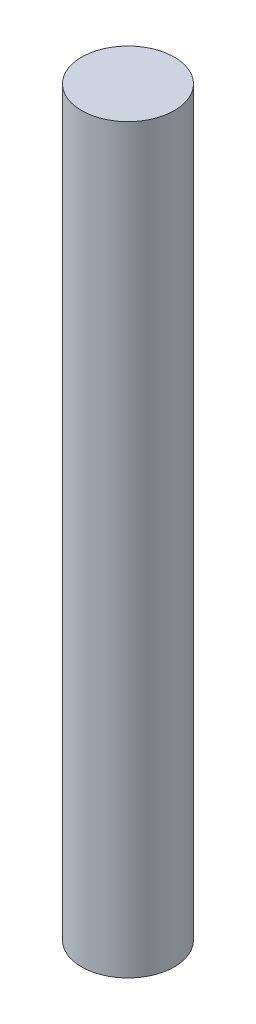
ISO-10303-21;
HEADER;
FILE_DESCRIPTION(('STEP AP214'),'2;1');
FILE_NAME('part.step','',(''),(''),'','','');
FILE_SCHEMA(('AUTOMOTIVE_DESIGN { 1 0 10303 214 1 1 1 1 }'));
ENDSEC;
DATA;
#1=APPLICATION_CONTEXT('core data for automotive mechanical design processes');
#2=APPLICATION_PROTOCOL_DEFINITION('international standard','automotive_design',2000,#1);
#3=PRODUCT_CONTEXT('',#1,'mechanical');
#4=PRODUCT('Part','Part','',(#3));
#5=PRODUCT_RELATED_PRODUCT_CATEGORY('part','',(#4));
#6=PRODUCT_DEFINITION_FORMATION('','',#4);
#7=PRODUCT_DEFINITION_CONTEXT('part definition',#1,'design');
#8=PRODUCT_DEFINITION('design','',#6,#7);
#9=PRODUCT_DEFINITION_SHAPE('','',#8);
#10=(LENGTH_UNIT() NAMED_UNIT(*) SI_UNIT(.MILLI.,.METRE.));
#11=(NAMED_UNIT(*) PLANE_ANGLE_UNIT() SI_UNIT($,.RADIAN.));
#12=(NAMED_UNIT(*) SI_UNIT($,.STERADIAN.) SOLID_ANGLE_UNIT());
#13=UNCERTAINTY_MEASURE_WITH_UNIT(LENGTH_MEASURE(1.E-05),#10,'distance_accuracy_value','');
#14=(GEOMETRIC_REPRESENTATION_CONTEXT(3) GLOBAL_UNCERTAINTY_ASSIGNED_CONTEXT((#13)) GLOBAL_UNIT_ASSIGNED_CONTEXT((#10,
#11,#12)) REPRESENTATION_CONTEXT('',''));
#15=CARTESIAN_POINT('',(0.,0.,0.));
#16=DIRECTION('',(0.,0.,1.));
#17=DIRECTION('',(1.,0.,0.));
#18=AXIS2_PLACEMENT_3D('',#15,#16,#17);
#19=CARTESIAN_POINT('',(0.,50.8,0.));
#20=DIRECTION('',(0.,-1.,0.));
#21=DIRECTION('',(0.,0.,-1.));
#22=AXIS2_PLACEMENT_3D('',#19,#20,#21);
#23=CYLINDRICAL_SURFACE('',#22,3.175);
#24=CARTESIAN_POINT('',(0.,50.8,0.));
#25=DIRECTION('',(0.,1.,0.));
#26=DIRECTION('',(0.,0.,1.));
#27=AXIS2_PLACEMENT_3D('',#24,#25,#26);
#28=CIRCLE('',#27,3.175);
#29=CARTESIAN_POINT('',(0.,50.8,3.175));
#30=VERTEX_POINT('',#29);
#31=EDGE_CURVE('E10',#30,#30,#28,.T.);
#32=ORIENTED_EDGE('',*,*,#31,.F.);
#33=EDGE_LOOP('',(#32));
#34=FACE_BOUND('',#33,.T.);
#35=CARTESIAN_POINT('',(0.,0.,0.));
#36=DIRECTION('',(0.,1.,0.));
#37=DIRECTION('',(0.,0.,1.));
#38=AXIS2_PLACEMENT_3D('',#35,#36,#37);
#39=CIRCLE('',#38,3.175);
#40=CARTESIAN_POINT('',(0.,0.,3.175));
#41=VERTEX_POINT('',#40);
#42=EDGE_CURVE('E37',#41,#41,#39,.T.);
#43=ORIENTED_EDGE('',*,*,#42,.T.);
#44=EDGE_LOOP('',(#43));
#45=FACE_BOUND('',#44,.T.);
#46=ADVANCED_FACE('F34',(#34,#45),#23,.T.);
#47=CARTESIAN_POINT('',(0.,50.8,0.));
#48=DIRECTION('',(0.,1.,0.));
#49=DIRECTION('',(0.,0.,1.));
#50=AXIS2_PLACEMENT_3D('',#47,#48,#49);
#51=PLANE('',#50);
#52=ORIENTED_EDGE('',*,*,#31,.T.);
#53=EDGE_LOOP('',(#52));
#54=FACE_BOUND('',#53,.T.);
#55=ADVANCED_FACE('F51',(#54),#51,.T.);
#56=CARTESIAN_POINT('',(0.,0.,0.));
#57=DIRECTION('',(0.,1.,0.));
#58=DIRECTION('',(0.,0.,1.));
#59=AXIS2_PLACEMENT_3D('',#56,#57,#58);
#60=PLANE('',#59);
#61=ORIENTED_EDGE('',*,*,#42,.F.);
#62=EDGE_LOOP('',(#61));
#63=FACE_BOUND('',#62,.T.);
#64=ADVANCED_FACE('F49',(#63),#60,.F.);
#65=CLOSED_SHELL('',(#46,#55,#64));
#66=MANIFOLD_SOLID_BREP('B2',#65);
#67=ADVANCED_BREP_SHAPE_REPRESENTATION('',(#18,#66),#14);
#68=SHAPE_DEFINITION_REPRESENTATION(#9,#67);
ENDSEC;
END-ISO-10303-21;
